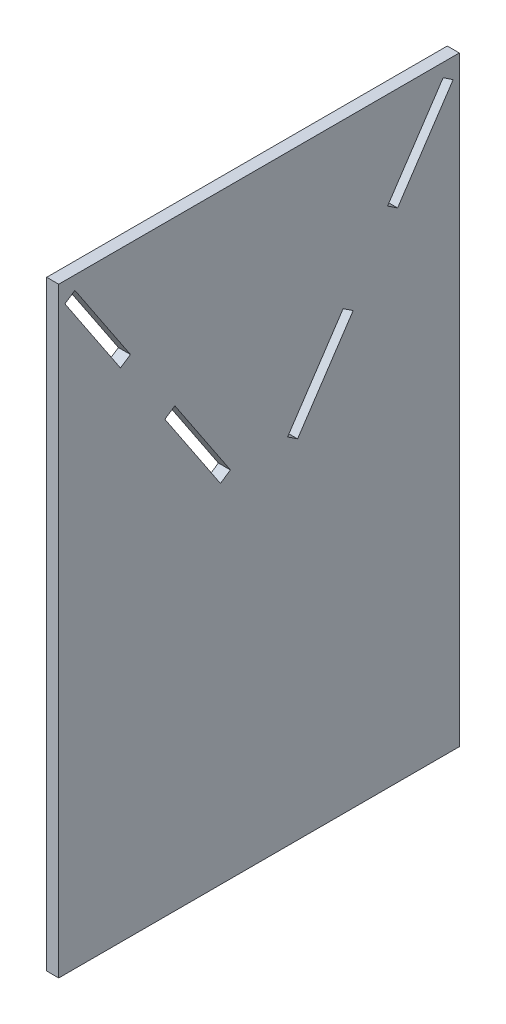
ISO-10303-21;
HEADER;
FILE_DESCRIPTION(('STEP AP214'),'2;1');
FILE_NAME('part.step','',(''),(''),'','','');
FILE_SCHEMA(('AUTOMOTIVE_DESIGN { 1 0 10303 214 1 1 1 1 }'));
ENDSEC;
DATA;
#1=APPLICATION_CONTEXT('core data for automotive mechanical design processes');
#2=APPLICATION_PROTOCOL_DEFINITION('international standard','automotive_design',2000,#1);
#3=PRODUCT_CONTEXT('',#1,'mechanical');
#4=PRODUCT('Part','Part','',(#3));
#5=PRODUCT_RELATED_PRODUCT_CATEGORY('part','',(#4));
#6=PRODUCT_DEFINITION_FORMATION('','',#4);
#7=PRODUCT_DEFINITION_CONTEXT('part definition',#1,'design');
#8=PRODUCT_DEFINITION('design','',#6,#7);
#9=PRODUCT_DEFINITION_SHAPE('','',#8);
#10=(LENGTH_UNIT() NAMED_UNIT(*) SI_UNIT(.MILLI.,.METRE.));
#11=(NAMED_UNIT(*) PLANE_ANGLE_UNIT() SI_UNIT($,.RADIAN.));
#12=(NAMED_UNIT(*) SI_UNIT($,.STERADIAN.) SOLID_ANGLE_UNIT());
#13=UNCERTAINTY_MEASURE_WITH_UNIT(LENGTH_MEASURE(1.E-05),#10,'distance_accuracy_value','');
#14=(GEOMETRIC_REPRESENTATION_CONTEXT(3) GLOBAL_UNCERTAINTY_ASSIGNED_CONTEXT((#13)) GLOBAL_UNIT_ASSIGNED_CONTEXT((#10,
#11,#12)) REPRESENTATION_CONTEXT('',''));
#15=CARTESIAN_POINT('',(0.,0.,0.));
#16=DIRECTION('',(0.,0.,1.));
#17=DIRECTION('',(1.,0.,0.));
#18=AXIS2_PLACEMENT_3D('',#15,#16,#17);
#19=CARTESIAN_POINT('',(6.,0.,0.));
#20=DIRECTION('',(-1.,0.,0.));
#21=DIRECTION('',(0.,0.,1.));
#22=AXIS2_PLACEMENT_3D('',#19,#20,#21);
#23=PLANE('',#22);
#24=DIRECTION('',(0.,0.554700196225229,0.832050294337844));
#25=VECTOR('',#24,1.);
#26=CARTESIAN_POINT('',(6.,65.094090383741,-47.0016115312905));
#27=LINE('',#26,#25);
#28=CARTESIAN_POINT('',(6.,65.094090383741,-47.0016115312905));
#29=VERTEX_POINT('',#28);
#30=CARTESIAN_POINT('',(6.,68.4222915610916,-42.0093097652646));
#31=VERTEX_POINT('',#30);
#32=EDGE_CURVE('E207',#29,#31,#27,.T.);
#33=ORIENTED_EDGE('',*,*,#32,.F.);
#34=DIRECTION('',(0.,0.83205029433786,-0.554700196225205));
#35=VECTOR('',#34,1.);
#36=CARTESIAN_POINT('',(6.,23.491575666848,-19.2666017200302));
#37=LINE('',#36,#35);
#38=CARTESIAN_POINT('',(6.,23.491575666848,-19.2666017200302));
#39=VERTEX_POINT('',#38);
#40=EDGE_CURVE('E215',#39,#29,#37,.T.);
#41=ORIENTED_EDGE('',*,*,#40,.F.);
#42=DIRECTION('',(0.,-0.554700196225229,-0.832050294337843));
#43=VECTOR('',#42,1.);
#44=CARTESIAN_POINT('',(6.,23.491575666848,-19.2666017200302));
#45=LINE('',#44,#43);
#46=CARTESIAN_POINT('',(6.,26.8197768442002,-14.274299954002));
#47=VERTEX_POINT('',#46);
#48=EDGE_CURVE('E212',#47,#39,#45,.T.);
#49=ORIENTED_EDGE('',*,*,#48,.F.);
#50=DIRECTION('',(0.,-0.832050294337829,0.554700196225251));
#51=VECTOR('',#50,1.);
#52=CARTESIAN_POINT('',(6.,26.8197768442002,-14.274299954002));
#53=LINE('',#52,#51);
#54=EDGE_CURVE('E209',#31,#47,#53,.T.);
#55=ORIENTED_EDGE('',*,*,#54,.F.);
#56=EDGE_LOOP('',(#33,#41,#49,#55));
#57=FACE_BOUND('',#56,.T.);
#58=DIRECTION('',(0.,0.832050294337845,0.554700196225227));
#59=VECTOR('',#58,1.);
#60=CARTESIAN_POINT('',(6.,143.306818051417,91.9323274254802));
#61=LINE('',#60,#59);
#62=CARTESIAN_POINT('',(6.,101.704303334524,64.1973176142189));
#63=VERTEX_POINT('',#62);
#64=CARTESIAN_POINT('',(6.,143.306818051417,91.9323274254802));
#65=VERTEX_POINT('',#64);
#66=EDGE_CURVE('E269',#63,#65,#61,.T.);
#67=ORIENTED_EDGE('',*,*,#66,.F.);
#68=DIRECTION('',(0.,0.554700196225231,-0.832050294337842));
#69=VECTOR('',#68,1.);
#70=CARTESIAN_POINT('',(6.,101.704303334524,64.1973176142189));
#71=LINE('',#70,#69);
#72=CARTESIAN_POINT('',(6.,98.3761021571729,69.189619380246));
#73=VERTEX_POINT('',#72);
#74=EDGE_CURVE('E277',#73,#63,#71,.T.);
#75=ORIENTED_EDGE('',*,*,#74,.F.);
#76=DIRECTION('',(0.,-0.832050294337844,-0.554700196225229));
#77=VECTOR('',#76,1.);
#78=CARTESIAN_POINT('',(6.,139.978616874065,96.9246291915074));
#79=LINE('',#78,#77);
#80=CARTESIAN_POINT('',(6.,139.978616874065,96.9246291915074));
#81=VERTEX_POINT('',#80);
#82=EDGE_CURVE('E274',#81,#73,#79,.T.);
#83=ORIENTED_EDGE('',*,*,#82,.F.);
#84=DIRECTION('',(0.,-0.554700196225229,0.832050294337844));
#85=VECTOR('',#84,1.);
#86=CARTESIAN_POINT('',(6.,143.306818051417,91.9323274254802));
#87=LINE('',#86,#85);
#88=EDGE_CURVE('E271',#65,#81,#87,.T.);
#89=ORIENTED_EDGE('',*,*,#88,.F.);
#90=EDGE_LOOP('',(#67,#75,#83,#89));
#91=FACE_BOUND('',#90,.T.);
#92=DIRECTION('',(0.,-1.,0.));
#93=VECTOR('',#92,1.);
#94=CARTESIAN_POINT('',(6.,150.,100.));
#95=LINE('',#94,#93);
#96=CARTESIAN_POINT('',(6.,150.,100.));
#97=VERTEX_POINT('',#96);
#98=CARTESIAN_POINT('',(6.,-150.,100.));
#99=VERTEX_POINT('',#98);
#100=EDGE_CURVE('E300',#97,#99,#95,.T.);
#101=ORIENTED_EDGE('',*,*,#100,.T.);
#102=DIRECTION('',(0.,0.,-1.));
#103=VECTOR('',#102,1.);
#104=CARTESIAN_POINT('',(6.,-150.,-100.));
#105=LINE('',#104,#103);
#106=CARTESIAN_POINT('',(6.,-150.,-100.));
#107=VERTEX_POINT('',#106);
#108=EDGE_CURVE('E303',#99,#107,#105,.T.);
#109=ORIENTED_EDGE('',*,*,#108,.T.);
#110=DIRECTION('',(0.,1.,0.));
#111=VECTOR('',#110,1.);
#112=CARTESIAN_POINT('',(6.,150.,-100.));
#113=LINE('',#112,#111);
#114=CARTESIAN_POINT('',(6.,150.,-100.));
#115=VERTEX_POINT('',#114);
#116=EDGE_CURVE('E306',#107,#115,#113,.T.);
#117=ORIENTED_EDGE('',*,*,#116,.T.);
#118=DIRECTION('',(0.,0.,1.));
#119=VECTOR('',#118,1.);
#120=CARTESIAN_POINT('',(6.,150.,-100.));
#121=LINE('',#120,#119);
#122=EDGE_CURVE('E308',#115,#97,#121,.T.);
#123=ORIENTED_EDGE('',*,*,#122,.T.);
#124=EDGE_LOOP('',(#101,#109,#117,#123));
#125=FACE_BOUND('',#124,.T.);
#126=DIRECTION('',(0.,-0.832050294337859,-0.554700196225205));
#127=VECTOR('',#126,1.);
#128=CARTESIAN_POINT('',(6.,23.491575666848,19.2666017200302));
#129=LINE('',#128,#127);
#130=CARTESIAN_POINT('',(6.,65.094090383741,47.0016115312905));
#131=VERTEX_POINT('',#130);
#132=CARTESIAN_POINT('',(6.,23.491575666848,19.2666017200302));
#133=VERTEX_POINT('',#132);
#134=EDGE_CURVE('E238',#131,#133,#129,.T.);
#135=ORIENTED_EDGE('',*,*,#134,.F.);
#136=DIRECTION('',(0.,-0.554700196225229,0.832050294337844));
#137=VECTOR('',#136,1.);
#138=CARTESIAN_POINT('',(6.,65.094090383741,47.0016115312905));
#139=LINE('',#138,#137);
#140=CARTESIAN_POINT('',(6.,68.4222915610916,42.0093097652646));
#141=VERTEX_POINT('',#140);
#142=EDGE_CURVE('E246',#141,#131,#139,.T.);
#143=ORIENTED_EDGE('',*,*,#142,.F.);
#144=DIRECTION('',(0.,0.832050294337829,0.554700196225252));
#145=VECTOR('',#144,1.);
#146=CARTESIAN_POINT('',(6.,26.8197768442002,14.274299954002));
#147=LINE('',#146,#145);
#148=CARTESIAN_POINT('',(6.,26.8197768442002,14.274299954002));
#149=VERTEX_POINT('',#148);
#150=EDGE_CURVE('E243',#149,#141,#147,.T.);
#151=ORIENTED_EDGE('',*,*,#150,.F.);
#152=DIRECTION('',(0.,0.554700196225229,-0.832050294337844));
#153=VECTOR('',#152,1.);
#154=CARTESIAN_POINT('',(6.,23.491575666848,19.2666017200302));
#155=LINE('',#154,#153);
#156=EDGE_CURVE('E240',#133,#149,#155,.T.);
#157=ORIENTED_EDGE('',*,*,#156,.F.);
#158=EDGE_LOOP('',(#135,#143,#151,#157));
#159=FACE_BOUND('',#158,.T.);
#160=DIRECTION('',(0.,0.554700196225229,0.832050294337844));
#161=VECTOR('',#160,1.);
#162=CARTESIAN_POINT('',(6.,143.306818051417,-91.9323274254802));
#163=LINE('',#162,#161);
#164=CARTESIAN_POINT('',(6.,139.978616874065,-96.9246291915074));
#165=VERTEX_POINT('',#164);
#166=CARTESIAN_POINT('',(6.,143.306818051417,-91.9323274254802));
#167=VERTEX_POINT('',#166);
#168=EDGE_CURVE('E171',#165,#167,#163,.T.);
#169=ORIENTED_EDGE('',*,*,#168,.F.);
#170=DIRECTION('',(0.,0.832050294337843,-0.55470019622523));
#171=VECTOR('',#170,1.);
#172=CARTESIAN_POINT('',(6.,139.978616874065,-96.9246291915074));
#173=LINE('',#172,#171);
#174=CARTESIAN_POINT('',(6.,98.3761021571729,-69.1896193802459));
#175=VERTEX_POINT('',#174);
#176=EDGE_CURVE('E193',#175,#165,#173,.T.);
#177=ORIENTED_EDGE('',*,*,#176,.F.);
#178=DIRECTION('',(0.,-0.554700196225231,-0.832050294337843));
#179=VECTOR('',#178,1.);
#180=CARTESIAN_POINT('',(6.,101.704303334524,-64.1973176142188));
#181=LINE('',#180,#179);
#182=CARTESIAN_POINT('',(6.,101.704303334524,-64.1973176142188));
#183=VERTEX_POINT('',#182);
#184=EDGE_CURVE('E191',#183,#175,#181,.T.);
#185=ORIENTED_EDGE('',*,*,#184,.F.);
#186=DIRECTION('',(0.,-0.832050294337844,0.554700196225228));
#187=VECTOR('',#186,1.);
#188=CARTESIAN_POINT('',(6.,143.306818051417,-91.9323274254802));
#189=LINE('',#188,#187);
#190=EDGE_CURVE('E179',#167,#183,#189,.T.);
#191=ORIENTED_EDGE('',*,*,#190,.F.);
#192=EDGE_LOOP('',(#169,#177,#185,#191));
#193=FACE_BOUND('',#192,.T.);
#194=ADVANCED_FACE('F34',(#57,#91,#125,#159,#193),#23,.F.);
#195=CARTESIAN_POINT('',(0.,0.,0.));
#196=DIRECTION('',(-1.,0.,0.));
#197=DIRECTION('',(0.,0.,1.));
#198=AXIS2_PLACEMENT_3D('',#195,#196,#197);
#199=PLANE('',#198);
#200=DIRECTION('',(0.,-1.,0.));
#201=VECTOR('',#200,1.);
#202=CARTESIAN_POINT('',(0.,150.,100.));
#203=LINE('',#202,#201);
#204=CARTESIAN_POINT('',(0.,150.,100.));
#205=VERTEX_POINT('',#204);
#206=CARTESIAN_POINT('',(0.,-150.,100.));
#207=VERTEX_POINT('',#206);
#208=EDGE_CURVE('E299',#205,#207,#203,.T.);
#209=ORIENTED_EDGE('',*,*,#208,.F.);
#210=DIRECTION('',(0.,0.,1.));
#211=VECTOR('',#210,1.);
#212=CARTESIAN_POINT('',(0.,150.,-100.));
#213=LINE('',#212,#211);
#214=CARTESIAN_POINT('',(0.,150.,-100.));
#215=VERTEX_POINT('',#214);
#216=EDGE_CURVE('E304',#215,#205,#213,.T.);
#217=ORIENTED_EDGE('',*,*,#216,.F.);
#218=DIRECTION('',(0.,1.,0.));
#219=VECTOR('',#218,1.);
#220=CARTESIAN_POINT('',(0.,150.,-100.));
#221=LINE('',#220,#219);
#222=CARTESIAN_POINT('',(0.,-150.,-100.));
#223=VERTEX_POINT('',#222);
#224=EDGE_CURVE('E315',#223,#215,#221,.T.);
#225=ORIENTED_EDGE('',*,*,#224,.F.);
#226=DIRECTION('',(0.,0.,-1.));
#227=VECTOR('',#226,1.);
#228=CARTESIAN_POINT('',(0.,-150.,-100.));
#229=LINE('',#228,#227);
#230=EDGE_CURVE('E313',#207,#223,#229,.T.);
#231=ORIENTED_EDGE('',*,*,#230,.F.);
#232=EDGE_LOOP('',(#209,#217,#225,#231));
#233=FACE_BOUND('',#232,.T.);
#234=DIRECTION('',(0.,0.554700196225231,-0.832050294337842));
#235=VECTOR('',#234,1.);
#236=CARTESIAN_POINT('',(0.,101.704303334524,64.1973176142189));
#237=LINE('',#236,#235);
#238=CARTESIAN_POINT('',(0.,98.3761021571728,69.189619380246));
#239=VERTEX_POINT('',#238);
#240=CARTESIAN_POINT('',(0.,101.704303334524,64.1973176142189));
#241=VERTEX_POINT('',#240);
#242=EDGE_CURVE('E272',#239,#241,#237,.T.);
#243=ORIENTED_EDGE('',*,*,#242,.T.);
#244=DIRECTION('',(0.,0.832050294337845,0.554700196225227));
#245=VECTOR('',#244,1.);
#246=CARTESIAN_POINT('',(0.,143.306818051417,91.9323274254802));
#247=LINE('',#246,#245);
#248=CARTESIAN_POINT('',(0.,143.306818051417,91.9323274254802));
#249=VERTEX_POINT('',#248);
#250=EDGE_CURVE('E268',#241,#249,#247,.T.);
#251=ORIENTED_EDGE('',*,*,#250,.T.);
#252=DIRECTION('',(0.,-0.554700196225229,0.832050294337844));
#253=VECTOR('',#252,1.);
#254=CARTESIAN_POINT('',(0.,143.306818051417,91.9323274254802));
#255=LINE('',#254,#253);
#256=CARTESIAN_POINT('',(0.,139.978616874065,96.9246291915074));
#257=VERTEX_POINT('',#256);
#258=EDGE_CURVE('E282',#249,#257,#255,.T.);
#259=ORIENTED_EDGE('',*,*,#258,.T.);
#260=DIRECTION('',(0.,-0.832050294337844,-0.554700196225229));
#261=VECTOR('',#260,1.);
#262=CARTESIAN_POINT('',(0.,139.978616874065,96.9246291915074));
#263=LINE('',#262,#261);
#264=EDGE_CURVE('E285',#257,#239,#263,.T.);
#265=ORIENTED_EDGE('',*,*,#264,.T.);
#266=EDGE_LOOP('',(#243,#251,#259,#265));
#267=FACE_BOUND('',#266,.T.);
#268=DIRECTION('',(0.,-0.554700196225229,0.832050294337844));
#269=VECTOR('',#268,1.);
#270=CARTESIAN_POINT('',(0.,65.094090383741,47.0016115312905));
#271=LINE('',#270,#269);
#272=CARTESIAN_POINT('',(0.,68.4222915610916,42.0093097652646));
#273=VERTEX_POINT('',#272);
#274=CARTESIAN_POINT('',(0.,65.094090383741,47.0016115312905));
#275=VERTEX_POINT('',#274);
#276=EDGE_CURVE('E241',#273,#275,#271,.T.);
#277=ORIENTED_EDGE('',*,*,#276,.T.);
#278=DIRECTION('',(0.,-0.832050294337859,-0.554700196225205));
#279=VECTOR('',#278,1.);
#280=CARTESIAN_POINT('',(0.,23.491575666848,19.2666017200302));
#281=LINE('',#280,#279);
#282=CARTESIAN_POINT('',(0.,23.491575666848,19.2666017200302));
#283=VERTEX_POINT('',#282);
#284=EDGE_CURVE('E237',#275,#283,#281,.T.);
#285=ORIENTED_EDGE('',*,*,#284,.T.);
#286=DIRECTION('',(0.,0.554700196225229,-0.832050294337844));
#287=VECTOR('',#286,1.);
#288=CARTESIAN_POINT('',(0.,23.491575666848,19.2666017200302));
#289=LINE('',#288,#287);
#290=CARTESIAN_POINT('',(0.,26.8197768442002,14.274299954002));
#291=VERTEX_POINT('',#290);
#292=EDGE_CURVE('E251',#283,#291,#289,.T.);
#293=ORIENTED_EDGE('',*,*,#292,.T.);
#294=DIRECTION('',(0.,0.832050294337829,0.554700196225252));
#295=VECTOR('',#294,1.);
#296=CARTESIAN_POINT('',(0.,26.8197768442002,14.274299954002));
#297=LINE('',#296,#295);
#298=EDGE_CURVE('E254',#291,#273,#297,.T.);
#299=ORIENTED_EDGE('',*,*,#298,.T.);
#300=EDGE_LOOP('',(#277,#285,#293,#299));
#301=FACE_BOUND('',#300,.T.);
#302=DIRECTION('',(0.,0.83205029433786,-0.554700196225205));
#303=VECTOR('',#302,1.);
#304=CARTESIAN_POINT('',(0.,23.491575666848,-19.2666017200302));
#305=LINE('',#304,#303);
#306=CARTESIAN_POINT('',(0.,23.491575666848,-19.2666017200302));
#307=VERTEX_POINT('',#306);
#308=CARTESIAN_POINT('',(0.,65.094090383741,-47.0016115312905));
#309=VERTEX_POINT('',#308);
#310=EDGE_CURVE('E210',#307,#309,#305,.T.);
#311=ORIENTED_EDGE('',*,*,#310,.T.);
#312=DIRECTION('',(0.,0.554700196225229,0.832050294337844));
#313=VECTOR('',#312,1.);
#314=CARTESIAN_POINT('',(0.,65.094090383741,-47.0016115312905));
#315=LINE('',#314,#313);
#316=CARTESIAN_POINT('',(0.,68.4222915610916,-42.0093097652646));
#317=VERTEX_POINT('',#316);
#318=EDGE_CURVE('E187',#309,#317,#315,.T.);
#319=ORIENTED_EDGE('',*,*,#318,.T.);
#320=DIRECTION('',(0.,-0.832050294337829,0.554700196225251));
#321=VECTOR('',#320,1.);
#322=CARTESIAN_POINT('',(0.,26.8197768442002,-14.274299954002));
#323=LINE('',#322,#321);
#324=CARTESIAN_POINT('',(0.,26.8197768442002,-14.274299954002));
#325=VERTEX_POINT('',#324);
#326=EDGE_CURVE('E220',#317,#325,#323,.T.);
#327=ORIENTED_EDGE('',*,*,#326,.T.);
#328=DIRECTION('',(0.,-0.554700196225229,-0.832050294337843));
#329=VECTOR('',#328,1.);
#330=CARTESIAN_POINT('',(0.,23.491575666848,-19.2666017200302));
#331=LINE('',#330,#329);
#332=EDGE_CURVE('E223',#325,#307,#331,.T.);
#333=ORIENTED_EDGE('',*,*,#332,.T.);
#334=EDGE_LOOP('',(#311,#319,#327,#333));
#335=FACE_BOUND('',#334,.T.);
#336=DIRECTION('',(0.,0.832050294337843,-0.55470019622523));
#337=VECTOR('',#336,1.);
#338=CARTESIAN_POINT('',(0.,139.978616874065,-96.9246291915074));
#339=LINE('',#338,#337);
#340=CARTESIAN_POINT('',(0.,98.3761021571729,-69.1896193802459));
#341=VERTEX_POINT('',#340);
#342=CARTESIAN_POINT('',(0.,139.978616874065,-96.9246291915074));
#343=VERTEX_POINT('',#342);
#344=EDGE_CURVE('E180',#341,#343,#339,.T.);
#345=ORIENTED_EDGE('',*,*,#344,.T.);
#346=DIRECTION('',(0.,0.554700196225229,0.832050294337844));
#347=VECTOR('',#346,1.);
#348=CARTESIAN_POINT('',(0.,143.306818051417,-91.9323274254802));
#349=LINE('',#348,#347);
#350=CARTESIAN_POINT('',(0.,143.306818051417,-91.9323274254802));
#351=VERTEX_POINT('',#350);
#352=EDGE_CURVE('E57',#343,#351,#349,.T.);
#353=ORIENTED_EDGE('',*,*,#352,.T.);
#354=DIRECTION('',(0.,-0.832050294337844,0.554700196225228));
#355=VECTOR('',#354,1.);
#356=CARTESIAN_POINT('',(0.,143.306818051417,-91.9323274254802));
#357=LINE('',#356,#355);
#358=CARTESIAN_POINT('',(0.,101.704303334524,-64.1973176142188));
#359=VERTEX_POINT('',#358);
#360=EDGE_CURVE('E186',#351,#359,#357,.T.);
#361=ORIENTED_EDGE('',*,*,#360,.T.);
#362=DIRECTION('',(0.,-0.554700196225231,-0.832050294337843));
#363=VECTOR('',#362,1.);
#364=CARTESIAN_POINT('',(0.,101.704303334524,-64.1973176142188));
#365=LINE('',#364,#363);
#366=EDGE_CURVE('E199',#359,#341,#365,.T.);
#367=ORIENTED_EDGE('',*,*,#366,.T.);
#368=EDGE_LOOP('',(#345,#353,#361,#367));
#369=FACE_BOUND('',#368,.T.);
#370=ADVANCED_FACE('F333',(#233,#267,#301,#335,#369),#199,.T.);
#371=CARTESIAN_POINT('',(6.,150.,100.));
#372=DIRECTION('',(0.,0.,-1.));
#373=DIRECTION('',(0.,1.,0.));
#374=AXIS2_PLACEMENT_3D('',#371,#372,#373);
#375=PLANE('',#374);
#376=ORIENTED_EDGE('',*,*,#208,.T.);
#377=DIRECTION('',(-1.,0.,0.));
#378=VECTOR('',#377,1.);
#379=CARTESIAN_POINT('',(6.,-150.,100.));
#380=LINE('',#379,#378);
#381=EDGE_CURVE('E11',#99,#207,#380,.T.);
#382=ORIENTED_EDGE('',*,*,#381,.F.);
#383=ORIENTED_EDGE('',*,*,#100,.F.);
#384=DIRECTION('',(-1.,0.,0.));
#385=VECTOR('',#384,1.);
#386=CARTESIAN_POINT('',(6.,150.,100.));
#387=LINE('',#386,#385);
#388=EDGE_CURVE('E310',#97,#205,#387,.T.);
#389=ORIENTED_EDGE('',*,*,#388,.T.);
#390=EDGE_LOOP('',(#376,#382,#383,#389));
#391=FACE_BOUND('',#390,.T.);
#392=ADVANCED_FACE('F36',(#391),#375,.F.);
#393=CARTESIAN_POINT('',(6.,-150.,-100.));
#394=DIRECTION('',(0.,1.,0.));
#395=DIRECTION('',(0.,0.,1.));
#396=AXIS2_PLACEMENT_3D('',#393,#394,#395);
#397=PLANE('',#396);
#398=ORIENTED_EDGE('',*,*,#230,.T.);
#399=DIRECTION('',(-1.,0.,0.));
#400=VECTOR('',#399,1.);
#401=CARTESIAN_POINT('',(6.,-150.,-100.));
#402=LINE('',#401,#400);
#403=EDGE_CURVE('E42',#107,#223,#402,.T.);
#404=ORIENTED_EDGE('',*,*,#403,.F.);
#405=ORIENTED_EDGE('',*,*,#108,.F.);
#406=ORIENTED_EDGE('',*,*,#381,.T.);
#407=EDGE_LOOP('',(#398,#404,#405,#406));
#408=FACE_BOUND('',#407,.T.);
#409=ADVANCED_FACE('F344',(#408),#397,.F.);
#410=CARTESIAN_POINT('',(6.,150.,-100.));
#411=DIRECTION('',(0.,0.,1.));
#412=DIRECTION('',(0.,-1.,0.));
#413=AXIS2_PLACEMENT_3D('',#410,#411,#412);
#414=PLANE('',#413);
#415=ORIENTED_EDGE('',*,*,#224,.T.);
#416=DIRECTION('',(-1.,0.,0.));
#417=VECTOR('',#416,1.);
#418=CARTESIAN_POINT('',(6.,150.,-100.));
#419=LINE('',#418,#417);
#420=EDGE_CURVE('E320',#115,#215,#419,.T.);
#421=ORIENTED_EDGE('',*,*,#420,.F.);
#422=ORIENTED_EDGE('',*,*,#116,.F.);
#423=ORIENTED_EDGE('',*,*,#403,.T.);
#424=EDGE_LOOP('',(#415,#421,#422,#423));
#425=FACE_BOUND('',#424,.T.);
#426=ADVANCED_FACE('F327',(#425),#414,.F.);
#427=CARTESIAN_POINT('',(6.,150.,-100.));
#428=DIRECTION('',(0.,-1.,0.));
#429=DIRECTION('',(0.,0.,-1.));
#430=AXIS2_PLACEMENT_3D('',#427,#428,#429);
#431=PLANE('',#430);
#432=ORIENTED_EDGE('',*,*,#216,.T.);
#433=ORIENTED_EDGE('',*,*,#388,.F.);
#434=ORIENTED_EDGE('',*,*,#122,.F.);
#435=ORIENTED_EDGE('',*,*,#420,.T.);
#436=EDGE_LOOP('',(#432,#433,#434,#435));
#437=FACE_BOUND('',#436,.T.);
#438=ADVANCED_FACE('F337',(#437),#431,.F.);
#439=CARTESIAN_POINT('',(6.,143.306818051417,91.9323274254802));
#440=DIRECTION('',(0.,-0.554700196225226,0.832050294337845));
#441=DIRECTION('',(0.,-0.832050294337845,-0.554700196225227));
#442=AXIS2_PLACEMENT_3D('',#439,#440,#441);
#443=PLANE('',#442);
#444=ORIENTED_EDGE('',*,*,#250,.F.);
#445=DIRECTION('',(-1.,0.,0.));
#446=VECTOR('',#445,1.);
#447=CARTESIAN_POINT('',(6.,101.704303334524,64.1973176142189));
#448=LINE('',#447,#446);
#449=EDGE_CURVE('E279',#63,#241,#448,.T.);
#450=ORIENTED_EDGE('',*,*,#449,.F.);
#451=ORIENTED_EDGE('',*,*,#66,.T.);
#452=DIRECTION('',(-1.,0.,0.));
#453=VECTOR('',#452,1.);
#454=CARTESIAN_POINT('',(6.,143.306818051417,91.9323274254802));
#455=LINE('',#454,#453);
#456=EDGE_CURVE('E296',#65,#249,#455,.T.);
#457=ORIENTED_EDGE('',*,*,#456,.T.);
#458=EDGE_LOOP('',(#444,#450,#451,#457));
#459=FACE_BOUND('',#458,.T.);
#460=ADVANCED_FACE('F361',(#459),#443,.T.);
#461=CARTESIAN_POINT('',(6.,143.306818051417,91.9323274254802));
#462=DIRECTION('',(0.,-0.832050294337843,-0.554700196225229));
#463=DIRECTION('',(0.,0.554700196225229,-0.832050294337844));
#464=AXIS2_PLACEMENT_3D('',#461,#462,#463);
#465=PLANE('',#464);
#466=ORIENTED_EDGE('',*,*,#258,.F.);
#467=ORIENTED_EDGE('',*,*,#456,.F.);
#468=ORIENTED_EDGE('',*,*,#88,.T.);
#469=DIRECTION('',(-1.,0.,0.));
#470=VECTOR('',#469,1.);
#471=CARTESIAN_POINT('',(6.,139.978616874065,96.9246291915074));
#472=LINE('',#471,#470);
#473=EDGE_CURVE('E294',#81,#257,#472,.T.);
#474=ORIENTED_EDGE('',*,*,#473,.T.);
#475=EDGE_LOOP('',(#466,#467,#468,#474));
#476=FACE_BOUND('',#475,.T.);
#477=ADVANCED_FACE('F368',(#476),#465,.T.);
#478=CARTESIAN_POINT('',(6.,139.978616874065,96.9246291915074));
#479=DIRECTION('',(0.,0.554700196225229,-0.832050294337844));
#480=DIRECTION('',(0.,0.832050294337844,0.554700196225229));
#481=AXIS2_PLACEMENT_3D('',#478,#479,#480);
#482=PLANE('',#481);
#483=ORIENTED_EDGE('',*,*,#264,.F.);
#484=ORIENTED_EDGE('',*,*,#473,.F.);
#485=ORIENTED_EDGE('',*,*,#82,.T.);
#486=DIRECTION('',(-1.,0.,0.));
#487=VECTOR('',#486,1.);
#488=CARTESIAN_POINT('',(6.,98.3761021571728,69.189619380246));
#489=LINE('',#488,#487);
#490=EDGE_CURVE('E292',#73,#239,#489,.T.);
#491=ORIENTED_EDGE('',*,*,#490,.T.);
#492=EDGE_LOOP('',(#483,#484,#485,#491));
#493=FACE_BOUND('',#492,.T.);
#494=ADVANCED_FACE('F373',(#493),#482,.T.);
#495=CARTESIAN_POINT('',(6.,101.704303334524,64.1973176142189));
#496=DIRECTION('',(0.,0.832050294337842,0.554700196225231));
#497=DIRECTION('',(0.,-0.554700196225231,0.832050294337842));
#498=AXIS2_PLACEMENT_3D('',#495,#496,#497);
#499=PLANE('',#498);
#500=ORIENTED_EDGE('',*,*,#242,.F.);
#501=ORIENTED_EDGE('',*,*,#490,.F.);
#502=ORIENTED_EDGE('',*,*,#74,.T.);
#503=ORIENTED_EDGE('',*,*,#449,.T.);
#504=EDGE_LOOP('',(#500,#501,#502,#503));
#505=FACE_BOUND('',#504,.T.);
#506=ADVANCED_FACE('F380',(#505),#499,.T.);
#507=CARTESIAN_POINT('',(6.,23.491575666848,19.2666017200302));
#508=DIRECTION('',(0.,0.554700196225205,-0.832050294337859));
#509=DIRECTION('',(0.,0.83205029433786,0.554700196225206));
#510=AXIS2_PLACEMENT_3D('',#507,#508,#509);
#511=PLANE('',#510);
#512=ORIENTED_EDGE('',*,*,#284,.F.);
#513=DIRECTION('',(-1.,0.,0.));
#514=VECTOR('',#513,1.);
#515=CARTESIAN_POINT('',(6.,65.094090383741,47.0016115312905));
#516=LINE('',#515,#514);
#517=EDGE_CURVE('E248',#131,#275,#516,.T.);
#518=ORIENTED_EDGE('',*,*,#517,.F.);
#519=ORIENTED_EDGE('',*,*,#134,.T.);
#520=DIRECTION('',(-1.,0.,0.));
#521=VECTOR('',#520,1.);
#522=CARTESIAN_POINT('',(6.,23.491575666848,19.2666017200302));
#523=LINE('',#522,#521);
#524=EDGE_CURVE('E265',#133,#283,#523,.T.);
#525=ORIENTED_EDGE('',*,*,#524,.T.);
#526=EDGE_LOOP('',(#512,#518,#519,#525));
#527=FACE_BOUND('',#526,.T.);
#528=ADVANCED_FACE('F393',(#527),#511,.T.);
#529=CARTESIAN_POINT('',(6.,23.491575666848,19.2666017200302));
#530=DIRECTION('',(0.,0.832050294337844,0.554700196225229));
#531=DIRECTION('',(0.,-0.554700196225229,0.832050294337844));
#532=AXIS2_PLACEMENT_3D('',#529,#530,#531);
#533=PLANE('',#532);
#534=ORIENTED_EDGE('',*,*,#292,.F.);
#535=ORIENTED_EDGE('',*,*,#524,.F.);
#536=ORIENTED_EDGE('',*,*,#156,.T.);
#537=DIRECTION('',(-1.,0.,0.));
#538=VECTOR('',#537,1.);
#539=CARTESIAN_POINT('',(6.,26.8197768442002,14.274299954002));
#540=LINE('',#539,#538);
#541=EDGE_CURVE('E263',#149,#291,#540,.T.);
#542=ORIENTED_EDGE('',*,*,#541,.T.);
#543=EDGE_LOOP('',(#534,#535,#536,#542));
#544=FACE_BOUND('',#543,.T.);
#545=ADVANCED_FACE('F398',(#544),#533,.T.);
#546=CARTESIAN_POINT('',(6.,26.8197768442002,14.274299954002));
#547=DIRECTION('',(0.,-0.554700196225252,0.832050294337829));
#548=DIRECTION('',(0.,-0.832050294337829,-0.554700196225252));
#549=AXIS2_PLACEMENT_3D('',#546,#547,#548);
#550=PLANE('',#549);
#551=ORIENTED_EDGE('',*,*,#298,.F.);
#552=ORIENTED_EDGE('',*,*,#541,.F.);
#553=ORIENTED_EDGE('',*,*,#150,.T.);
#554=DIRECTION('',(-1.,0.,0.));
#555=VECTOR('',#554,1.);
#556=CARTESIAN_POINT('',(6.,68.4222915610916,42.0093097652646));
#557=LINE('',#556,#555);
#558=EDGE_CURVE('E261',#141,#273,#557,.T.);
#559=ORIENTED_EDGE('',*,*,#558,.T.);
#560=EDGE_LOOP('',(#551,#552,#553,#559));
#561=FACE_BOUND('',#560,.T.);
#562=ADVANCED_FACE('F402',(#561),#550,.T.);
#563=CARTESIAN_POINT('',(6.,65.094090383741,47.0016115312905));
#564=DIRECTION('',(0.,-0.832050294337843,-0.554700196225229));
#565=DIRECTION('',(0.,0.554700196225229,-0.832050294337844));
#566=AXIS2_PLACEMENT_3D('',#563,#564,#565);
#567=PLANE('',#566);
#568=ORIENTED_EDGE('',*,*,#276,.F.);
#569=ORIENTED_EDGE('',*,*,#558,.F.);
#570=ORIENTED_EDGE('',*,*,#142,.T.);
#571=ORIENTED_EDGE('',*,*,#517,.T.);
#572=EDGE_LOOP('',(#568,#569,#570,#571));
#573=FACE_BOUND('',#572,.T.);
#574=ADVANCED_FACE('F406',(#573),#567,.T.);
#575=CARTESIAN_POINT('',(6.,65.094090383741,-47.0016115312905));
#576=DIRECTION('',(0.,-0.832050294337843,0.554700196225229));
#577=DIRECTION('',(0.,-0.554700196225229,-0.832050294337844));
#578=AXIS2_PLACEMENT_3D('',#575,#576,#577);
#579=PLANE('',#578);
#580=ORIENTED_EDGE('',*,*,#318,.F.);
#581=DIRECTION('',(-1.,0.,0.));
#582=VECTOR('',#581,1.);
#583=CARTESIAN_POINT('',(6.,65.094090383741,-47.0016115312905));
#584=LINE('',#583,#582);
#585=EDGE_CURVE('E217',#29,#309,#584,.T.);
#586=ORIENTED_EDGE('',*,*,#585,.F.);
#587=ORIENTED_EDGE('',*,*,#32,.T.);
#588=DIRECTION('',(-1.,0.,0.));
#589=VECTOR('',#588,1.);
#590=CARTESIAN_POINT('',(6.,68.4222915610916,-42.0093097652646));
#591=LINE('',#590,#589);
#592=EDGE_CURVE('E234',#31,#317,#591,.T.);
#593=ORIENTED_EDGE('',*,*,#592,.T.);
#594=EDGE_LOOP('',(#580,#586,#587,#593));
#595=FACE_BOUND('',#594,.T.);
#596=ADVANCED_FACE('F410',(#595),#579,.T.);
#597=CARTESIAN_POINT('',(6.,26.8197768442002,-14.274299954002));
#598=DIRECTION('',(0.,-0.554700196225251,-0.832050294337829));
#599=DIRECTION('',(0.,0.832050294337829,-0.554700196225251));
#600=AXIS2_PLACEMENT_3D('',#597,#598,#599);
#601=PLANE('',#600);
#602=ORIENTED_EDGE('',*,*,#326,.F.);
#603=ORIENTED_EDGE('',*,*,#592,.F.);
#604=ORIENTED_EDGE('',*,*,#54,.T.);
#605=DIRECTION('',(-1.,0.,0.));
#606=VECTOR('',#605,1.);
#607=CARTESIAN_POINT('',(6.,26.8197768442002,-14.274299954002));
#608=LINE('',#607,#606);
#609=EDGE_CURVE('E232',#47,#325,#608,.T.);
#610=ORIENTED_EDGE('',*,*,#609,.T.);
#611=EDGE_LOOP('',(#602,#603,#604,#610));
#612=FACE_BOUND('',#611,.T.);
#613=ADVANCED_FACE('F414',(#612),#601,.T.);
#614=CARTESIAN_POINT('',(6.,23.491575666848,-19.2666017200302));
#615=DIRECTION('',(0.,0.832050294337844,-0.554700196225229));
#616=DIRECTION('',(0.,0.554700196225229,0.832050294337843));
#617=AXIS2_PLACEMENT_3D('',#614,#615,#616);
#618=PLANE('',#617);
#619=ORIENTED_EDGE('',*,*,#332,.F.);
#620=ORIENTED_EDGE('',*,*,#609,.F.);
#621=ORIENTED_EDGE('',*,*,#48,.T.);
#622=DIRECTION('',(-1.,0.,0.));
#623=VECTOR('',#622,1.);
#624=CARTESIAN_POINT('',(6.,23.491575666848,-19.2666017200302));
#625=LINE('',#624,#623);
#626=EDGE_CURVE('E230',#39,#307,#625,.T.);
#627=ORIENTED_EDGE('',*,*,#626,.T.);
#628=EDGE_LOOP('',(#619,#620,#621,#627));
#629=FACE_BOUND('',#628,.T.);
#630=ADVANCED_FACE('F418',(#629),#618,.T.);
#631=CARTESIAN_POINT('',(6.,23.491575666848,-19.2666017200302));
#632=DIRECTION('',(0.,0.554700196225205,0.83205029433786));
#633=DIRECTION('',(0.,-0.83205029433786,0.554700196225205));
#634=AXIS2_PLACEMENT_3D('',#631,#632,#633);
#635=PLANE('',#634);
#636=ORIENTED_EDGE('',*,*,#310,.F.);
#637=ORIENTED_EDGE('',*,*,#626,.F.);
#638=ORIENTED_EDGE('',*,*,#40,.T.);
#639=ORIENTED_EDGE('',*,*,#585,.T.);
#640=EDGE_LOOP('',(#636,#637,#638,#639));
#641=FACE_BOUND('',#640,.T.);
#642=ADVANCED_FACE('F422',(#641),#635,.T.);
#643=CARTESIAN_POINT('',(6.,143.306818051417,-91.9323274254802));
#644=DIRECTION('',(0.,-0.832050294337843,0.554700196225229));
#645=DIRECTION('',(0.,-0.554700196225229,-0.832050294337844));
#646=AXIS2_PLACEMENT_3D('',#643,#644,#645);
#647=PLANE('',#646);
#648=ORIENTED_EDGE('',*,*,#352,.F.);
#649=DIRECTION('',(-1.,0.,0.));
#650=VECTOR('',#649,1.);
#651=CARTESIAN_POINT('',(6.,139.978616874065,-96.9246291915074));
#652=LINE('',#651,#650);
#653=EDGE_CURVE('E175',#165,#343,#652,.T.);
#654=ORIENTED_EDGE('',*,*,#653,.F.);
#655=ORIENTED_EDGE('',*,*,#168,.T.);
#656=DIRECTION('',(-1.,0.,0.));
#657=VECTOR('',#656,1.);
#658=CARTESIAN_POINT('',(6.,143.306818051417,-91.9323274254802));
#659=LINE('',#658,#657);
#660=EDGE_CURVE('E174',#167,#351,#659,.T.);
#661=ORIENTED_EDGE('',*,*,#660,.T.);
#662=EDGE_LOOP('',(#648,#654,#655,#661));
#663=FACE_BOUND('',#662,.T.);
#664=ADVANCED_FACE('F173',(#663),#647,.T.);
#665=CARTESIAN_POINT('',(6.,143.306818051417,-91.9323274254802));
#666=DIRECTION('',(0.,-0.554700196225228,-0.832050294337844));
#667=DIRECTION('',(0.,0.832050294337844,-0.554700196225228));
#668=AXIS2_PLACEMENT_3D('',#665,#666,#667);
#669=PLANE('',#668);
#670=ORIENTED_EDGE('',*,*,#360,.F.);
#671=ORIENTED_EDGE('',*,*,#660,.F.);
#672=ORIENTED_EDGE('',*,*,#190,.T.);
#673=DIRECTION('',(-1.,0.,0.));
#674=VECTOR('',#673,1.);
#675=CARTESIAN_POINT('',(6.,101.704303334524,-64.1973176142188));
#676=LINE('',#675,#674);
#677=EDGE_CURVE('E188',#183,#359,#676,.T.);
#678=ORIENTED_EDGE('',*,*,#677,.T.);
#679=EDGE_LOOP('',(#670,#671,#672,#678));
#680=FACE_BOUND('',#679,.T.);
#681=ADVANCED_FACE('F183',(#680),#669,.T.);
#682=CARTESIAN_POINT('',(6.,101.704303334524,-64.1973176142188));
#683=DIRECTION('',(0.,0.832050294337843,-0.554700196225231));
#684=DIRECTION('',(0.,0.554700196225231,0.832050294337843));
#685=AXIS2_PLACEMENT_3D('',#682,#683,#684);
#686=PLANE('',#685);
#687=ORIENTED_EDGE('',*,*,#366,.F.);
#688=ORIENTED_EDGE('',*,*,#677,.F.);
#689=ORIENTED_EDGE('',*,*,#184,.T.);
#690=DIRECTION('',(-1.,0.,0.));
#691=VECTOR('',#690,1.);
#692=CARTESIAN_POINT('',(6.,98.3761021571729,-69.1896193802459));
#693=LINE('',#692,#691);
#694=EDGE_CURVE('E49',#175,#341,#693,.T.);
#695=ORIENTED_EDGE('',*,*,#694,.T.);
#696=EDGE_LOOP('',(#687,#688,#689,#695));
#697=FACE_BOUND('',#696,.T.);
#698=ADVANCED_FACE('F431',(#697),#686,.T.);
#699=CARTESIAN_POINT('',(6.,139.978616874065,-96.9246291915074));
#700=DIRECTION('',(0.,0.554700196225231,0.832050294337843));
#701=DIRECTION('',(0.,-0.832050294337843,0.554700196225231));
#702=AXIS2_PLACEMENT_3D('',#699,#700,#701);
#703=PLANE('',#702);
#704=ORIENTED_EDGE('',*,*,#344,.F.);
#705=ORIENTED_EDGE('',*,*,#694,.F.);
#706=ORIENTED_EDGE('',*,*,#176,.T.);
#707=ORIENTED_EDGE('',*,*,#653,.T.);
#708=EDGE_LOOP('',(#704,#705,#706,#707));
#709=FACE_BOUND('',#708,.T.);
#710=ADVANCED_FACE('F434',(#709),#703,.T.);
#711=CLOSED_SHELL('',(#194,#370,#392,#409,#426,#438,#460,#477,#494,#506,#528,#545,#562,#574,
#596,#613,#630,#642,#664,#681,#698,#710));
#712=MANIFOLD_SOLID_BREP('B2',#711);
#713=ADVANCED_BREP_SHAPE_REPRESENTATION('',(#18,#712),#14);
#714=SHAPE_DEFINITION_REPRESENTATION(#9,#713);
ENDSEC;
END-ISO-10303-21;
